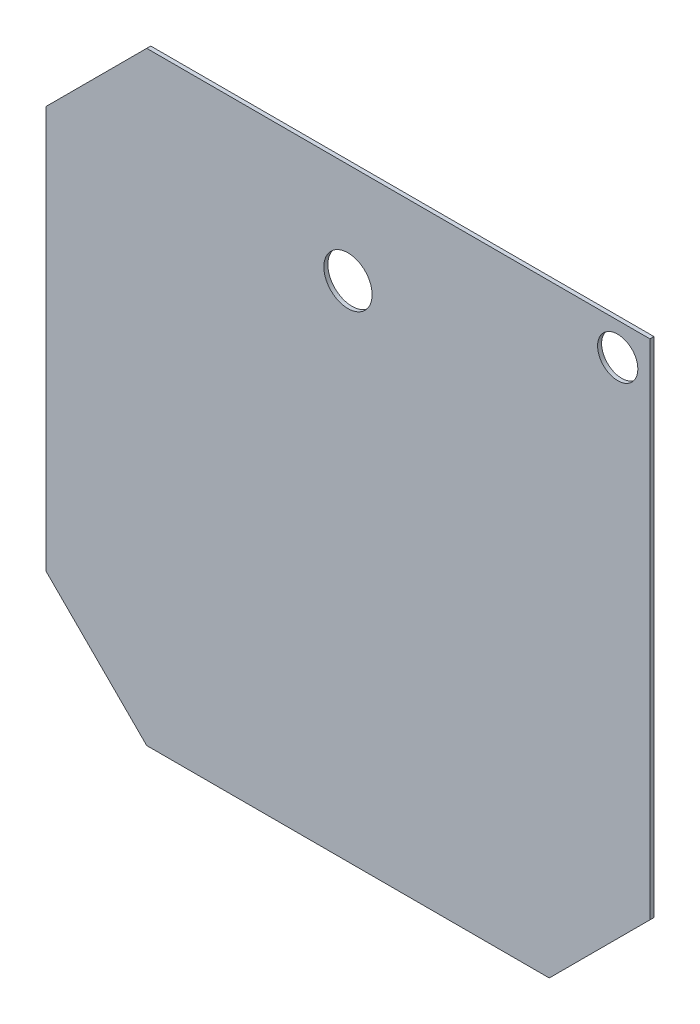
ISO-10303-21;
HEADER;
FILE_DESCRIPTION(('STEP AP214'),'2;1');
FILE_NAME('part.step','',(''),(''),'','','');
FILE_SCHEMA(('AUTOMOTIVE_DESIGN { 1 0 10303 214 1 1 1 1 }'));
ENDSEC;
DATA;
#1=APPLICATION_CONTEXT('core data for automotive mechanical design processes');
#2=APPLICATION_PROTOCOL_DEFINITION('international standard','automotive_design',2000,#1);
#3=PRODUCT_CONTEXT('',#1,'mechanical');
#4=PRODUCT('Part','Part','',(#3));
#5=PRODUCT_RELATED_PRODUCT_CATEGORY('part','',(#4));
#6=PRODUCT_DEFINITION_FORMATION('','',#4);
#7=PRODUCT_DEFINITION_CONTEXT('part definition',#1,'design');
#8=PRODUCT_DEFINITION('design','',#6,#7);
#9=PRODUCT_DEFINITION_SHAPE('','',#8);
#10=(LENGTH_UNIT() NAMED_UNIT(*) SI_UNIT(.MILLI.,.METRE.));
#11=(NAMED_UNIT(*) PLANE_ANGLE_UNIT() SI_UNIT($,.RADIAN.));
#12=(NAMED_UNIT(*) SI_UNIT($,.STERADIAN.) SOLID_ANGLE_UNIT());
#13=UNCERTAINTY_MEASURE_WITH_UNIT(LENGTH_MEASURE(1.E-05),#10,'distance_accuracy_value','');
#14=(GEOMETRIC_REPRESENTATION_CONTEXT(3) GLOBAL_UNCERTAINTY_ASSIGNED_CONTEXT((#13)) GLOBAL_UNIT_ASSIGNED_CONTEXT((#10,
#11,#12)) REPRESENTATION_CONTEXT('',''));
#15=CARTESIAN_POINT('',(0.,0.,0.));
#16=DIRECTION('',(0.,0.,1.));
#17=DIRECTION('',(1.,0.,0.));
#18=AXIS2_PLACEMENT_3D('',#15,#16,#17);
#19=CARTESIAN_POINT('',(0.,0.,1.));
#20=DIRECTION('',(0.,0.,-1.));
#21=DIRECTION('',(-1.,0.,0.));
#22=AXIS2_PLACEMENT_3D('',#19,#20,#21);
#23=PLANE('',#22);
#24=CARTESIAN_POINT('',(67.,67.,1.));
#25=DIRECTION('',(0.,0.,1.));
#26=DIRECTION('',(1.,0.,0.));
#27=AXIS2_PLACEMENT_3D('',#24,#25,#26);
#28=CIRCLE('',#27,5.00000000000001);
#29=CARTESIAN_POINT('',(72.,67.,1.));
#30=VERTEX_POINT('',#29);
#31=EDGE_CURVE('E169',#30,#30,#28,.T.);
#32=ORIENTED_EDGE('',*,*,#31,.F.);
#33=EDGE_LOOP('',(#32));
#34=FACE_BOUND('',#33,.T.);
#35=DIRECTION('',(0.,1.,0.));
#36=VECTOR('',#35,1.);
#37=CARTESIAN_POINT('',(75.,-49.9999999999997,1.));
#38=LINE('',#37,#36);
#39=CARTESIAN_POINT('',(75.,-49.9999999999997,1.));
#40=VERTEX_POINT('',#39);
#41=CARTESIAN_POINT('',(75.,75.,1.));
#42=VERTEX_POINT('',#41);
#43=EDGE_CURVE('E139',#40,#42,#38,.T.);
#44=ORIENTED_EDGE('',*,*,#43,.T.);
#45=DIRECTION('',(-1.,0.,0.));
#46=VECTOR('',#45,1.);
#47=CARTESIAN_POINT('',(-50.,75.,1.));
#48=LINE('',#47,#46);
#49=CARTESIAN_POINT('',(-50.,75.,1.));
#50=VERTEX_POINT('',#49);
#51=EDGE_CURVE('E92',#42,#50,#48,.T.);
#52=ORIENTED_EDGE('',*,*,#51,.T.);
#53=DIRECTION('',(-0.707106781186544,-0.707106781186551,0.));
#54=VECTOR('',#53,1.);
#55=CARTESIAN_POINT('',(-75.,49.9999999999997,1.));
#56=LINE('',#55,#54);
#57=CARTESIAN_POINT('',(-75.,49.9999999999997,1.));
#58=VERTEX_POINT('',#57);
#59=EDGE_CURVE('E152',#50,#58,#56,.T.);
#60=ORIENTED_EDGE('',*,*,#59,.T.);
#61=DIRECTION('',(0.,-1.,0.));
#62=VECTOR('',#61,1.);
#63=CARTESIAN_POINT('',(-75.,49.9999999999997,1.));
#64=LINE('',#63,#62);
#65=CARTESIAN_POINT('',(-75.,-49.9999999999997,1.));
#66=VERTEX_POINT('',#65);
#67=EDGE_CURVE('E108',#58,#66,#64,.T.);
#68=ORIENTED_EDGE('',*,*,#67,.T.);
#69=DIRECTION('',(0.707106781186543,-0.707106781186552,0.));
#70=VECTOR('',#69,1.);
#71=CARTESIAN_POINT('',(-75.,-49.9999999999997,1.));
#72=LINE('',#71,#70);
#73=CARTESIAN_POINT('',(-50.,-75.,1.));
#74=VERTEX_POINT('',#73);
#75=EDGE_CURVE('E102',#66,#74,#72,.T.);
#76=ORIENTED_EDGE('',*,*,#75,.T.);
#77=DIRECTION('',(1.,0.,0.));
#78=VECTOR('',#77,1.);
#79=CARTESIAN_POINT('',(-50.,-75.,1.));
#80=LINE('',#79,#78);
#81=CARTESIAN_POINT('',(50.,-75.,1.));
#82=VERTEX_POINT('',#81);
#83=EDGE_CURVE('E106',#74,#82,#80,.T.);
#84=ORIENTED_EDGE('',*,*,#83,.T.);
#85=DIRECTION('',(0.707106781186543,0.707106781186552,0.));
#86=VECTOR('',#85,1.);
#87=CARTESIAN_POINT('',(75.,-49.9999999999997,1.));
#88=LINE('',#87,#86);
#89=EDGE_CURVE('E52',#82,#40,#88,.T.);
#90=ORIENTED_EDGE('',*,*,#89,.T.);
#91=EDGE_LOOP('',(#44,#52,#60,#68,#76,#84,#90));
#92=FACE_BOUND('',#91,.T.);
#93=CARTESIAN_POINT('',(0.,49.9999999999997,1.));
#94=DIRECTION('',(0.,0.,1.));
#95=DIRECTION('',(1.,0.,0.));
#96=AXIS2_PLACEMENT_3D('',#93,#94,#95);
#97=CIRCLE('',#96,6.);
#98=CARTESIAN_POINT('',(6.,49.9999999999997,1.));
#99=VERTEX_POINT('',#98);
#100=EDGE_CURVE('E130',#99,#99,#97,.T.);
#101=ORIENTED_EDGE('',*,*,#100,.F.);
#102=EDGE_LOOP('',(#101));
#103=FACE_BOUND('',#102,.T.);
#104=ADVANCED_FACE('F34',(#34,#92,#103),#23,.F.);
#105=CARTESIAN_POINT('',(0.,0.,0.));
#106=DIRECTION('',(0.,0.,-1.));
#107=DIRECTION('',(-1.,0.,0.));
#108=AXIS2_PLACEMENT_3D('',#105,#106,#107);
#109=PLANE('',#108);
#110=CARTESIAN_POINT('',(67.,67.,0.));
#111=DIRECTION('',(0.,0.,-1.));
#112=DIRECTION('',(-1.,0.,0.));
#113=AXIS2_PLACEMENT_3D('',#110,#111,#112);
#114=CIRCLE('',#113,5.00000000000001);
#115=CARTESIAN_POINT('',(62.,67.,0.));
#116=VERTEX_POINT('',#115);
#117=EDGE_CURVE('E38',#116,#116,#114,.T.);
#118=ORIENTED_EDGE('',*,*,#117,.F.);
#119=EDGE_LOOP('',(#118));
#120=FACE_BOUND('',#119,.T.);
#121=DIRECTION('',(0.,1.,0.));
#122=VECTOR('',#121,1.);
#123=CARTESIAN_POINT('',(75.,-49.9999999999997,0.));
#124=LINE('',#123,#122);
#125=CARTESIAN_POINT('',(75.,-49.9999999999997,0.));
#126=VERTEX_POINT('',#125);
#127=CARTESIAN_POINT('',(75.,75.,0.));
#128=VERTEX_POINT('',#127);
#129=EDGE_CURVE('E126',#126,#128,#124,.T.);
#130=ORIENTED_EDGE('',*,*,#129,.F.);
#131=DIRECTION('',(0.707106781186543,0.707106781186552,0.));
#132=VECTOR('',#131,1.);
#133=CARTESIAN_POINT('',(75.,-49.9999999999997,0.));
#134=LINE('',#133,#132);
#135=CARTESIAN_POINT('',(50.,-75.,0.));
#136=VERTEX_POINT('',#135);
#137=EDGE_CURVE('E84',#136,#126,#134,.T.);
#138=ORIENTED_EDGE('',*,*,#137,.F.);
#139=DIRECTION('',(1.,0.,0.));
#140=VECTOR('',#139,1.);
#141=CARTESIAN_POINT('',(-50.,-75.,0.));
#142=LINE('',#141,#140);
#143=CARTESIAN_POINT('',(-50.,-75.,0.));
#144=VERTEX_POINT('',#143);
#145=EDGE_CURVE('E78',#144,#136,#142,.T.);
#146=ORIENTED_EDGE('',*,*,#145,.F.);
#147=DIRECTION('',(0.707106781186543,-0.707106781186552,0.));
#148=VECTOR('',#147,1.);
#149=CARTESIAN_POINT('',(-75.,-49.9999999999997,0.));
#150=LINE('',#149,#148);
#151=CARTESIAN_POINT('',(-75.,-49.9999999999997,0.));
#152=VERTEX_POINT('',#151);
#153=EDGE_CURVE('E116',#152,#144,#150,.T.);
#154=ORIENTED_EDGE('',*,*,#153,.F.);
#155=DIRECTION('',(0.,-1.,0.));
#156=VECTOR('',#155,1.);
#157=CARTESIAN_POINT('',(-75.,49.9999999999997,0.));
#158=LINE('',#157,#156);
#159=CARTESIAN_POINT('',(-75.,49.9999999999997,0.));
#160=VERTEX_POINT('',#159);
#161=EDGE_CURVE('E134',#160,#152,#158,.T.);
#162=ORIENTED_EDGE('',*,*,#161,.F.);
#163=DIRECTION('',(-0.707106781186544,-0.707106781186551,0.));
#164=VECTOR('',#163,1.);
#165=CARTESIAN_POINT('',(-75.,49.9999999999997,0.));
#166=LINE('',#165,#164);
#167=CARTESIAN_POINT('',(-50.,75.,0.));
#168=VERTEX_POINT('',#167);
#169=EDGE_CURVE('E132',#168,#160,#166,.T.);
#170=ORIENTED_EDGE('',*,*,#169,.F.);
#171=DIRECTION('',(-1.,0.,0.));
#172=VECTOR('',#171,1.);
#173=CARTESIAN_POINT('',(-50.,75.,0.));
#174=LINE('',#173,#172);
#175=EDGE_CURVE('E129',#128,#168,#174,.T.);
#176=ORIENTED_EDGE('',*,*,#175,.F.);
#177=EDGE_LOOP('',(#130,#138,#146,#154,#162,#170,#176));
#178=FACE_BOUND('',#177,.T.);
#179=CARTESIAN_POINT('',(0.,49.9999999999997,0.));
#180=DIRECTION('',(0.,0.,1.));
#181=DIRECTION('',(1.,0.,0.));
#182=AXIS2_PLACEMENT_3D('',#179,#180,#181);
#183=CIRCLE('',#182,6.);
#184=CARTESIAN_POINT('',(6.,49.9999999999997,0.));
#185=VERTEX_POINT('',#184);
#186=EDGE_CURVE('E164',#185,#185,#183,.T.);
#187=ORIENTED_EDGE('',*,*,#186,.T.);
#188=EDGE_LOOP('',(#187));
#189=FACE_BOUND('',#188,.T.);
#190=ADVANCED_FACE('F156',(#120,#178,#189),#109,.T.);
#191=CARTESIAN_POINT('',(75.,-49.9999999999997,1.));
#192=DIRECTION('',(-1.,0.,0.));
#193=DIRECTION('',(0.,0.,1.));
#194=AXIS2_PLACEMENT_3D('',#191,#192,#193);
#195=PLANE('',#194);
#196=ORIENTED_EDGE('',*,*,#129,.T.);
#197=DIRECTION('',(0.,0.,-1.));
#198=VECTOR('',#197,1.);
#199=CARTESIAN_POINT('',(75.,75.,1.));
#200=LINE('',#199,#198);
#201=EDGE_CURVE('E11',#42,#128,#200,.T.);
#202=ORIENTED_EDGE('',*,*,#201,.F.);
#203=ORIENTED_EDGE('',*,*,#43,.F.);
#204=DIRECTION('',(0.,0.,-1.));
#205=VECTOR('',#204,1.);
#206=CARTESIAN_POINT('',(75.,-49.9999999999997,1.));
#207=LINE('',#206,#205);
#208=EDGE_CURVE('E122',#40,#126,#207,.T.);
#209=ORIENTED_EDGE('',*,*,#208,.T.);
#210=EDGE_LOOP('',(#196,#202,#203,#209));
#211=FACE_BOUND('',#210,.T.);
#212=ADVANCED_FACE('F36',(#211),#195,.F.);
#213=CARTESIAN_POINT('',(-50.,75.,1.));
#214=DIRECTION('',(0.,-1.,0.));
#215=DIRECTION('',(0.,0.,-1.));
#216=AXIS2_PLACEMENT_3D('',#213,#214,#215);
#217=PLANE('',#216);
#218=ORIENTED_EDGE('',*,*,#175,.T.);
#219=DIRECTION('',(0.,0.,-1.));
#220=VECTOR('',#219,1.);
#221=CARTESIAN_POINT('',(-50.,75.,1.));
#222=LINE('',#221,#220);
#223=EDGE_CURVE('E44',#50,#168,#222,.T.);
#224=ORIENTED_EDGE('',*,*,#223,.F.);
#225=ORIENTED_EDGE('',*,*,#51,.F.);
#226=ORIENTED_EDGE('',*,*,#201,.T.);
#227=EDGE_LOOP('',(#218,#224,#225,#226));
#228=FACE_BOUND('',#227,.T.);
#229=ADVANCED_FACE('F184',(#228),#217,.F.);
#230=CARTESIAN_POINT('',(-75.,49.9999999999997,1.));
#231=DIRECTION('',(0.707106781186552,-0.707106781186544,0.));
#232=DIRECTION('',(0.707106781186544,0.707106781186552,0.));
#233=AXIS2_PLACEMENT_3D('',#230,#231,#232);
#234=PLANE('',#233);
#235=ORIENTED_EDGE('',*,*,#169,.T.);
#236=DIRECTION('',(0.,0.,-1.));
#237=VECTOR('',#236,1.);
#238=CARTESIAN_POINT('',(-75.,49.9999999999997,1.));
#239=LINE('',#238,#237);
#240=EDGE_CURVE('E143',#58,#160,#239,.T.);
#241=ORIENTED_EDGE('',*,*,#240,.F.);
#242=ORIENTED_EDGE('',*,*,#59,.F.);
#243=ORIENTED_EDGE('',*,*,#223,.T.);
#244=EDGE_LOOP('',(#235,#241,#242,#243));
#245=FACE_BOUND('',#244,.T.);
#246=ADVANCED_FACE('F150',(#245),#234,.F.);
#247=CARTESIAN_POINT('',(-75.,49.9999999999997,1.));
#248=DIRECTION('',(1.,0.,0.));
#249=DIRECTION('',(0.,0.,-1.));
#250=AXIS2_PLACEMENT_3D('',#247,#248,#249);
#251=PLANE('',#250);
#252=ORIENTED_EDGE('',*,*,#161,.T.);
#253=DIRECTION('',(0.,0.,-1.));
#254=VECTOR('',#253,1.);
#255=CARTESIAN_POINT('',(-75.,-49.9999999999997,1.));
#256=LINE('',#255,#254);
#257=EDGE_CURVE('E117',#66,#152,#256,.T.);
#258=ORIENTED_EDGE('',*,*,#257,.F.);
#259=ORIENTED_EDGE('',*,*,#67,.F.);
#260=ORIENTED_EDGE('',*,*,#240,.T.);
#261=EDGE_LOOP('',(#252,#258,#259,#260));
#262=FACE_BOUND('',#261,.T.);
#263=ADVANCED_FACE('F159',(#262),#251,.F.);
#264=CARTESIAN_POINT('',(-75.,-49.9999999999997,1.));
#265=DIRECTION('',(0.707106781186552,0.707106781186543,0.));
#266=DIRECTION('',(-0.707106781186543,0.707106781186552,0.));
#267=AXIS2_PLACEMENT_3D('',#264,#265,#266);
#268=PLANE('',#267);
#269=ORIENTED_EDGE('',*,*,#153,.T.);
#270=DIRECTION('',(0.,0.,-1.));
#271=VECTOR('',#270,1.);
#272=CARTESIAN_POINT('',(-50.,-75.,1.));
#273=LINE('',#272,#271);
#274=EDGE_CURVE('E113',#74,#144,#273,.T.);
#275=ORIENTED_EDGE('',*,*,#274,.F.);
#276=ORIENTED_EDGE('',*,*,#75,.F.);
#277=ORIENTED_EDGE('',*,*,#257,.T.);
#278=EDGE_LOOP('',(#269,#275,#276,#277));
#279=FACE_BOUND('',#278,.T.);
#280=ADVANCED_FACE('F114',(#279),#268,.F.);
#281=CARTESIAN_POINT('',(-50.,-75.,1.));
#282=DIRECTION('',(0.,1.,0.));
#283=DIRECTION('',(0.,0.,1.));
#284=AXIS2_PLACEMENT_3D('',#281,#282,#283);
#285=PLANE('',#284);
#286=ORIENTED_EDGE('',*,*,#145,.T.);
#287=DIRECTION('',(0.,0.,-1.));
#288=VECTOR('',#287,1.);
#289=CARTESIAN_POINT('',(50.,-75.,1.));
#290=LINE('',#289,#288);
#291=EDGE_CURVE('E118',#82,#136,#290,.T.);
#292=ORIENTED_EDGE('',*,*,#291,.F.);
#293=ORIENTED_EDGE('',*,*,#83,.F.);
#294=ORIENTED_EDGE('',*,*,#274,.T.);
#295=EDGE_LOOP('',(#286,#292,#293,#294));
#296=FACE_BOUND('',#295,.T.);
#297=ADVANCED_FACE('F120',(#296),#285,.F.);
#298=CARTESIAN_POINT('',(75.,-49.9999999999997,1.));
#299=DIRECTION('',(-0.707106781186552,0.707106781186543,0.));
#300=DIRECTION('',(-0.707106781186543,-0.707106781186552,0.));
#301=AXIS2_PLACEMENT_3D('',#298,#299,#300);
#302=PLANE('',#301);
#303=ORIENTED_EDGE('',*,*,#137,.T.);
#304=ORIENTED_EDGE('',*,*,#208,.F.);
#305=ORIENTED_EDGE('',*,*,#89,.F.);
#306=ORIENTED_EDGE('',*,*,#291,.T.);
#307=EDGE_LOOP('',(#303,#304,#305,#306));
#308=FACE_BOUND('',#307,.T.);
#309=ADVANCED_FACE('F190',(#308),#302,.F.);
#310=CARTESIAN_POINT('',(0.,49.9999999999997,1.));
#311=DIRECTION('',(0.,0.,-1.));
#312=DIRECTION('',(-1.,0.,0.));
#313=AXIS2_PLACEMENT_3D('',#310,#311,#312);
#314=CYLINDRICAL_SURFACE('',#313,6.);
#315=ORIENTED_EDGE('',*,*,#100,.T.);
#316=EDGE_LOOP('',(#315));
#317=FACE_BOUND('',#316,.T.);
#318=ORIENTED_EDGE('',*,*,#186,.F.);
#319=EDGE_LOOP('',(#318));
#320=FACE_BOUND('',#319,.T.);
#321=ADVANCED_FACE('F193',(#317,#320),#314,.F.);
#322=CARTESIAN_POINT('',(67.,67.,-9.));
#323=DIRECTION('',(0.,0.,1.));
#324=DIRECTION('',(1.,0.,0.));
#325=AXIS2_PLACEMENT_3D('',#322,#323,#324);
#326=CYLINDRICAL_SURFACE('',#325,5.00000000000001);
#327=ORIENTED_EDGE('',*,*,#117,.T.);
#328=EDGE_LOOP('',(#327));
#329=FACE_BOUND('',#328,.T.);
#330=ORIENTED_EDGE('',*,*,#31,.T.);
#331=EDGE_LOOP('',(#330));
#332=FACE_BOUND('',#331,.T.);
#333=ADVANCED_FACE('F176',(#329,#332),#326,.F.);
#334=CLOSED_SHELL('',(#104,#190,#212,#229,#246,#263,#280,#297,#309,#321,#333));
#335=MANIFOLD_SOLID_BREP('B2',#334);
#336=ADVANCED_BREP_SHAPE_REPRESENTATION('',(#18,#335),#14);
#337=SHAPE_DEFINITION_REPRESENTATION(#9,#336);
ENDSEC;
END-ISO-10303-21;
